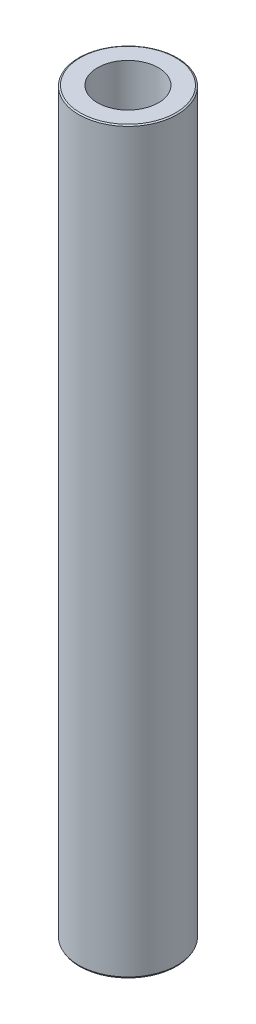
ISO-10303-21;
HEADER;
FILE_DESCRIPTION(('STEP AP214'),'2;1');
FILE_NAME('part.step','',(''),(''),'','','');
FILE_SCHEMA(('AUTOMOTIVE_DESIGN { 1 0 10303 214 1 1 1 1 }'));
ENDSEC;
DATA;
#1=APPLICATION_CONTEXT('core data for automotive mechanical design processes');
#2=APPLICATION_PROTOCOL_DEFINITION('international standard','automotive_design',2000,#1);
#3=PRODUCT_CONTEXT('',#1,'mechanical');
#4=PRODUCT('Part','Part','',(#3));
#5=PRODUCT_RELATED_PRODUCT_CATEGORY('part','',(#4));
#6=PRODUCT_DEFINITION_FORMATION('','',#4);
#7=PRODUCT_DEFINITION_CONTEXT('part definition',#1,'design');
#8=PRODUCT_DEFINITION('design','',#6,#7);
#9=PRODUCT_DEFINITION_SHAPE('','',#8);
#10=(LENGTH_UNIT() NAMED_UNIT(*) SI_UNIT(.MILLI.,.METRE.));
#11=(NAMED_UNIT(*) PLANE_ANGLE_UNIT() SI_UNIT($,.RADIAN.));
#12=(NAMED_UNIT(*) SI_UNIT($,.STERADIAN.) SOLID_ANGLE_UNIT());
#13=UNCERTAINTY_MEASURE_WITH_UNIT(LENGTH_MEASURE(1.E-05),#10,'distance_accuracy_value','');
#14=(GEOMETRIC_REPRESENTATION_CONTEXT(3) GLOBAL_UNCERTAINTY_ASSIGNED_CONTEXT((#13)) GLOBAL_UNIT_ASSIGNED_CONTEXT((#10,
#11,#12)) REPRESENTATION_CONTEXT('',''));
#15=CARTESIAN_POINT('',(0.,0.,0.));
#16=DIRECTION('',(0.,0.,1.));
#17=DIRECTION('',(1.,0.,0.));
#18=AXIS2_PLACEMENT_3D('',#15,#16,#17);
#19=CARTESIAN_POINT('',(0.,337.705211110645,0.));
#20=DIRECTION('',(0.,-1.,0.));
#21=DIRECTION('',(0.,0.,-1.));
#22=AXIS2_PLACEMENT_3D('',#19,#20,#21);
#23=CYLINDRICAL_SURFACE('',#22,22.5);
#24=CARTESIAN_POINT('',(0.,337.329565438735,0.));
#25=DIRECTION('',(0.,1.,0.));
#26=DIRECTION('',(0.,0.,1.));
#27=AXIS2_PLACEMENT_3D('',#24,#25,#26);
#28=CIRCLE('',#27,22.5);
#29=CARTESIAN_POINT('',(0.,337.329565438735,22.5));
#30=VERTEX_POINT('',#29);
#31=EDGE_CURVE('E50',#30,#30,#28,.F.);
#32=ORIENTED_EDGE('',*,*,#31,.T.);
#33=EDGE_LOOP('',(#32));
#34=FACE_BOUND('',#33,.T.);
#35=CARTESIAN_POINT('',(0.,0.66802040042524,0.));
#36=DIRECTION('',(0.,1.,0.));
#37=DIRECTION('',(0.,0.,1.));
#38=AXIS2_PLACEMENT_3D('',#35,#36,#37);
#39=CIRCLE('',#38,22.5);
#40=CARTESIAN_POINT('',(0.,0.66802040042524,22.5));
#41=VERTEX_POINT('',#40);
#42=EDGE_CURVE('E51',#41,#41,#39,.T.);
#43=ORIENTED_EDGE('',*,*,#42,.T.);
#44=EDGE_LOOP('',(#43));
#45=FACE_BOUND('',#44,.T.);
#46=ADVANCED_FACE('F39',(#34,#45),#23,.T.);
#47=CARTESIAN_POINT('',(0.,337.705211110645,0.));
#48=DIRECTION('',(0.,1.,0.));
#49=DIRECTION('',(0.,0.,1.));
#50=AXIS2_PLACEMENT_3D('',#47,#48,#49);
#51=PLANE('',#50);
#52=CARTESIAN_POINT('',(0.,337.705211110645,0.));
#53=DIRECTION('',(0.,1.,0.));
#54=DIRECTION('',(0.,0.,1.));
#55=AXIS2_PLACEMENT_3D('',#52,#53,#54);
#56=CIRCLE('',#55,21.8319795995746);
#57=CARTESIAN_POINT('',(0.,337.705211110645,21.8319795995746));
#58=VERTEX_POINT('',#57);
#59=EDGE_CURVE('E54',#58,#58,#56,.T.);
#60=ORIENTED_EDGE('',*,*,#59,.T.);
#61=EDGE_LOOP('',(#60));
#62=FACE_BOUND('',#61,.T.);
#63=CARTESIAN_POINT('',(0.,337.705211110645,0.));
#64=DIRECTION('',(0.,1.,0.));
#65=DIRECTION('',(0.,0.,1.));
#66=AXIS2_PLACEMENT_3D('',#63,#64,#65);
#67=CIRCLE('',#66,13.9181326918353);
#68=CARTESIAN_POINT('',(0.,337.705211110645,13.9181326918353));
#69=VERTEX_POINT('',#68);
#70=EDGE_CURVE('E58',#69,#69,#67,.T.);
#71=ORIENTED_EDGE('',*,*,#70,.F.);
#72=EDGE_LOOP('',(#71));
#73=FACE_BOUND('',#72,.T.);
#74=ADVANCED_FACE('F69',(#62,#73),#51,.T.);
#75=CARTESIAN_POINT('',(0.,0.,0.));
#76=DIRECTION('',(0.,1.,0.));
#77=DIRECTION('',(0.,0.,1.));
#78=AXIS2_PLACEMENT_3D('',#75,#76,#77);
#79=PLANE('',#78);
#80=CARTESIAN_POINT('',(0.,0.,0.));
#81=DIRECTION('',(0.,1.,0.));
#82=DIRECTION('',(0.,0.,1.));
#83=AXIS2_PLACEMENT_3D('',#80,#81,#82);
#84=CIRCLE('',#83,22.1243543280902);
#85=CARTESIAN_POINT('',(0.,0.,22.1243543280902));
#86=VERTEX_POINT('',#85);
#87=EDGE_CURVE('E10',#86,#86,#84,.F.);
#88=ORIENTED_EDGE('',*,*,#87,.T.);
#89=EDGE_LOOP('',(#88));
#90=FACE_BOUND('',#89,.T.);
#91=CARTESIAN_POINT('',(0.,0.,0.));
#92=DIRECTION('',(0.,1.,0.));
#93=DIRECTION('',(0.,0.,1.));
#94=AXIS2_PLACEMENT_3D('',#91,#92,#93);
#95=CIRCLE('',#94,13.9181326918353);
#96=CARTESIAN_POINT('',(0.,0.,13.9181326918353));
#97=VERTEX_POINT('',#96);
#98=EDGE_CURVE('E63',#97,#97,#95,.T.);
#99=ORIENTED_EDGE('',*,*,#98,.T.);
#100=EDGE_LOOP('',(#99));
#101=FACE_BOUND('',#100,.T.);
#102=ADVANCED_FACE('F75',(#90,#101),#79,.F.);
#103=CARTESIAN_POINT('',(0.,337.705211110645,0.));
#104=DIRECTION('',(0.,-1.,0.));
#105=DIRECTION('',(0.,0.,-1.));
#106=AXIS2_PLACEMENT_3D('',#103,#104,#105);
#107=CYLINDRICAL_SURFACE('',#106,13.9181326918353);
#108=ORIENTED_EDGE('',*,*,#70,.T.);
#109=EDGE_LOOP('',(#108));
#110=FACE_BOUND('',#109,.T.);
#111=ORIENTED_EDGE('',*,*,#98,.F.);
#112=EDGE_LOOP('',(#111));
#113=FACE_BOUND('',#112,.T.);
#114=ADVANCED_FACE('F70',(#110,#113),#107,.F.);
#115=CARTESIAN_POINT('',(0.,337.705211110645,0.));
#116=DIRECTION('',(0.,-1.,0.));
#117=DIRECTION('',(0.,0.,-1.));
#118=AXIS2_PLACEMENT_3D('',#115,#116,#117);
#119=CONICAL_SURFACE('',#118,21.8319795995746,1.05853856277794);
#120=ORIENTED_EDGE('',*,*,#31,.F.);
#121=EDGE_LOOP('',(#120));
#122=FACE_BOUND('',#121,.T.);
#123=ORIENTED_EDGE('',*,*,#59,.F.);
#124=EDGE_LOOP('',(#123));
#125=FACE_BOUND('',#124,.T.);
#126=ADVANCED_FACE('F81',(#122,#125),#119,.T.);
#127=CARTESIAN_POINT('',(0.,0.66802040042524,0.));
#128=DIRECTION('',(0.,1.,0.));
#129=DIRECTION('',(0.,0.,1.));
#130=AXIS2_PLACEMENT_3D('',#127,#128,#129);
#131=CONICAL_SURFACE('',#130,22.5,0.512257764016965);
#132=ORIENTED_EDGE('',*,*,#87,.F.);
#133=EDGE_LOOP('',(#132));
#134=FACE_BOUND('',#133,.T.);
#135=ORIENTED_EDGE('',*,*,#42,.F.);
#136=EDGE_LOOP('',(#135));
#137=FACE_BOUND('',#136,.T.);
#138=ADVANCED_FACE('F45',(#134,#137),#131,.T.);
#139=CLOSED_SHELL('',(#46,#74,#102,#114,#126,#138));
#140=MANIFOLD_SOLID_BREP('B2',#139);
#141=ADVANCED_BREP_SHAPE_REPRESENTATION('',(#18,#140),#14);
#142=SHAPE_DEFINITION_REPRESENTATION(#9,#141);
ENDSEC;
END-ISO-10303-21;
